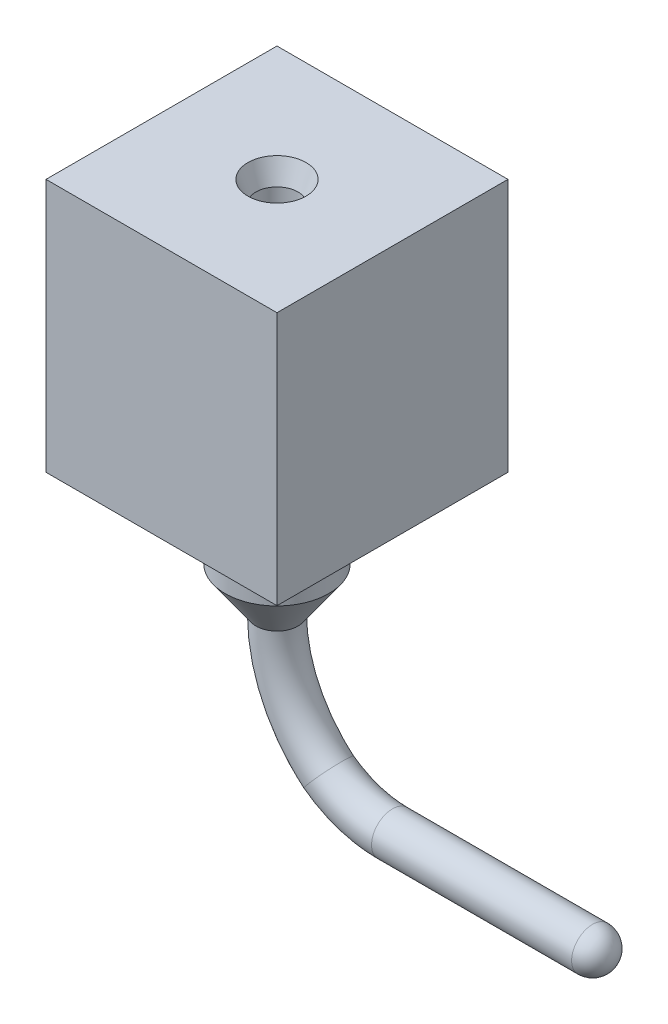
ISO-10303-21;
HEADER;
FILE_DESCRIPTION(('STEP AP214'),'2;1');
FILE_NAME('part.step','',(''),(''),'','','');
FILE_SCHEMA(('AUTOMOTIVE_DESIGN { 1 0 10303 214 1 1 1 1 }'));
ENDSEC;
DATA;
#1=APPLICATION_CONTEXT('core data for automotive mechanical design processes');
#2=APPLICATION_PROTOCOL_DEFINITION('international standard','automotive_design',2000,#1);
#3=PRODUCT_CONTEXT('',#1,'mechanical');
#4=PRODUCT('Part','Part','',(#3));
#5=PRODUCT_RELATED_PRODUCT_CATEGORY('part','',(#4));
#6=PRODUCT_DEFINITION_FORMATION('','',#4);
#7=PRODUCT_DEFINITION_CONTEXT('part definition',#1,'design');
#8=PRODUCT_DEFINITION('design','',#6,#7);
#9=PRODUCT_DEFINITION_SHAPE('','',#8);
#10=(LENGTH_UNIT() NAMED_UNIT(*) SI_UNIT(.MILLI.,.METRE.));
#11=(NAMED_UNIT(*) PLANE_ANGLE_UNIT() SI_UNIT($,.RADIAN.));
#12=(NAMED_UNIT(*) SI_UNIT($,.STERADIAN.) SOLID_ANGLE_UNIT());
#13=UNCERTAINTY_MEASURE_WITH_UNIT(LENGTH_MEASURE(1.E-05),#10,'distance_accuracy_value','');
#14=(GEOMETRIC_REPRESENTATION_CONTEXT(3) GLOBAL_UNCERTAINTY_ASSIGNED_CONTEXT((#13)) GLOBAL_UNIT_ASSIGNED_CONTEXT((#10,
#11,#12)) REPRESENTATION_CONTEXT('',''));
#15=CARTESIAN_POINT('',(0.,0.,0.));
#16=DIRECTION('',(0.,0.,1.));
#17=DIRECTION('',(1.,0.,0.));
#18=AXIS2_PLACEMENT_3D('',#15,#16,#17);
#19=CARTESIAN_POINT('',(-1.27,-0.87,1.27));
#20=DIRECTION('',(0.,1.,0.));
#21=DIRECTION('',(0.,0.,-1.));
#22=AXIS2_PLACEMENT_3D('',#19,#20,#21);
#23=CONICAL_SURFACE('',#22,0.57,0.616275758879199);
#24=CARTESIAN_POINT('',(-1.5,-1.35,1.27));
#25=CARTESIAN_POINT('',(-1.50000007983042,-1.35,1.26623663));
#26=CARTESIAN_POINT('',(-1.49990763593879,-1.35,1.26247326679278));
#27=CARTESIAN_POINT('',(-1.49953827391559,-1.35,1.25495560301661));
#28=CARTESIAN_POINT('',(-1.49926135578404,-1.35,1.25120130244766));
#29=CARTESIAN_POINT('',(-1.49852361848517,-1.35,1.24371081300074));
#30=CARTESIAN_POINT('',(-1.49806279931787,-1.35,1.23997462412276));
#31=CARTESIAN_POINT('',(-1.49695839526593,-1.35,1.23252935762777));
#32=CARTESIAN_POINT('',(-1.49631481038129,-1.35,1.22882028001076));
#33=CARTESIAN_POINT('',(-1.49484641860419,-1.35,1.22143817186182));
#34=CARTESIAN_POINT('',(-1.49402161171173,-1.35,1.21776514132989));
#35=CARTESIAN_POINT('',(-1.49219276475776,-1.35,1.21046397591461));
#36=CARTESIAN_POINT('',(-1.49118872469626,-1.35,1.20683584103127));
#37=CARTESIAN_POINT('',(-1.48900382974056,-1.35,1.19963320743168));
#38=CARTESIAN_POINT('',(-1.48782297484635,-1.35,1.19605870871543));
#39=CARTESIAN_POINT('',(-1.48528729513784,-1.35,1.18897195872415));
#40=CARTESIAN_POINT('',(-1.48393247032352,-1.35,1.18545970744912));
#41=CARTESIAN_POINT('',(-1.48105211463167,-1.35,1.17850591366294));
#42=CARTESIAN_POINT('',(-1.47952658375413,-1.35,1.17506437115179));
#43=CARTESIAN_POINT('',(-1.47630849108265,-1.35,1.16826028587028));
#44=CARTESIAN_POINT('',(-1.47461592928871,-1.35,1.16489774309991));
#45=CARTESIAN_POINT('',(-1.47106785231153,-1.35,1.15825975796013));
#46=CARTESIAN_POINT('',(-1.4692123371283,-1.35,1.15498431559072));
#47=CARTESIAN_POINT('',(-1.46534282347182,-1.35,1.1485284220804));
#48=CARTESIAN_POINT('',(-1.46332882499857,-1.35,1.14534797093948));
#49=CARTESIAN_POINT('',(-1.4591471966606,-1.35,1.13908972187151));
#50=CARTESIAN_POINT('',(-1.45697956679588,-1.35,1.13601192394446));
#51=CARTESIAN_POINT('',(-1.45249589768522,-1.35,1.12996639598902));
#52=CARTESIAN_POINT('',(-1.45017985843928,-1.35,1.12699866596063));
#53=CARTESIAN_POINT('',(-1.44540495010758,-1.35,1.12118042332409));
#54=CARTESIAN_POINT('',(-1.44294608102182,-1.35,1.11832991071594));
#55=CARTESIAN_POINT('',(-1.43789143664147,-1.35,1.11275297005443));
#56=CARTESIAN_POINT('',(-1.43529566134688,-1.35,1.11002654200107));
#57=CARTESIAN_POINT('',(-1.42997345799893,-1.35,1.10470433865312));
#58=CARTESIAN_POINT('',(-1.42724702994557,-1.35,1.10210856335853));
#59=CARTESIAN_POINT('',(-1.42167008928406,-1.35,1.09705391897819));
#60=CARTESIAN_POINT('',(-1.41881957667591,-1.35,1.09459504989242));
#61=CARTESIAN_POINT('',(-1.41300133403937,-1.35,1.08982014156072));
#62=CARTESIAN_POINT('',(-1.41003360401098,-1.35,1.08750410231478));
#63=CARTESIAN_POINT('',(-1.40398807605554,-1.35,1.08302043320413));
#64=CARTESIAN_POINT('',(-1.40091027812849,-1.35,1.08085280333941));
#65=CARTESIAN_POINT('',(-1.39465202906053,-1.35,1.07667117500142));
#66=CARTESIAN_POINT('',(-1.39147157791961,-1.35,1.07465717652814));
#67=CARTESIAN_POINT('',(-1.38501568440927,-1.35,1.07078766287174));
#68=CARTESIAN_POINT('',(-1.38174024203986,-1.35,1.06893214768862));
#69=CARTESIAN_POINT('',(-1.3751022569001,-1.35,1.06538407071114));
#70=CARTESIAN_POINT('',(-1.37173971412975,-1.35,1.06369150891678));
#71=CARTESIAN_POINT('',(-1.36493562884818,-1.35,1.06047341624644));
#72=CARTESIAN_POINT('',(-1.36149408633696,-1.35,1.05894788537045));
#73=CARTESIAN_POINT('',(-1.35454029255099,-1.35,1.05606752967436));
#74=CARTESIAN_POINT('',(-1.35102804127624,-1.35,1.05471270485425));
#75=CARTESIAN_POINT('',(-1.34394129128418,-1.35,1.05217702516156));
#76=CARTESIAN_POINT('',(-1.34036679256687,-1.35,1.05099617028899));
#77=CARTESIAN_POINT('',(-1.33316415897018,-1.35,1.0488112752742));
#78=CARTESIAN_POINT('',(-1.32953602409081,-1.35,1.04780723513198));
#79=CARTESIAN_POINT('',(-1.3222348586647,-1.35,1.04597838839854));
#80=CARTESIAN_POINT('',(-1.31856182811796,-1.35,1.04515358180732));
#81=CARTESIAN_POINT('',(-1.31117972000945,-1.35,1.0436851892072));
#82=CARTESIAN_POINT('',(-1.30747064244768,-1.35,1.0430416031983));
#83=CARTESIAN_POINT('',(-1.30002537580179,-1.35,1.0419372022179));
#84=CARTESIAN_POINT('',(-1.29628918671769,-1.35,1.04147638724639));
#85=CARTESIAN_POINT('',(-1.28879869783391,-1.35,1.0407386384844));
#86=CARTESIAN_POINT('',(-1.28504439803424,-1.35,1.04046170469391));
#87=CARTESIAN_POINT('',(-1.27752673215638,-1.35,1.04009238545171));
#88=CARTESIAN_POINT('',(-1.27376336607819,-1.35,1.04));
#89=CARTESIAN_POINT('',(-1.26623663392181,-1.35,1.04));
#90=CARTESIAN_POINT('',(-1.26247326784362,-1.35,1.04009238545171));
#91=CARTESIAN_POINT('',(-1.25495560196576,-1.35,1.04046170469391));
#92=CARTESIAN_POINT('',(-1.25120130216609,-1.35,1.0407386384844));
#93=CARTESIAN_POINT('',(-1.24371081328231,-1.35,1.04147638724639));
#94=CARTESIAN_POINT('',(-1.23997462419821,-1.35,1.0419372022179));
#95=CARTESIAN_POINT('',(-1.23252935755233,-1.35,1.0430416031983));
#96=CARTESIAN_POINT('',(-1.22882027999055,-1.35,1.0436851892072));
#97=CARTESIAN_POINT('',(-1.22143817188204,-1.35,1.04515358180732));
#98=CARTESIAN_POINT('',(-1.2177651413353,-1.35,1.04597838839854));
#99=CARTESIAN_POINT('',(-1.2104639759092,-1.35,1.04780723513198));
#100=CARTESIAN_POINT('',(-1.20683584102982,-1.35,1.0488112752742));
#101=CARTESIAN_POINT('',(-1.19963320743313,-1.35,1.05099617028899));
#102=CARTESIAN_POINT('',(-1.19605870871582,-1.35,1.05217702516156));
#103=CARTESIAN_POINT('',(-1.18897195872376,-1.35,1.05471270485425));
#104=CARTESIAN_POINT('',(-1.18545970744901,-1.35,1.05606752967436));
#105=CARTESIAN_POINT('',(-1.17850591366304,-1.35,1.05894788537045));
#106=CARTESIAN_POINT('',(-1.17506437115182,-1.35,1.06047341624644));
#107=CARTESIAN_POINT('',(-1.16826028587025,-1.35,1.06369150891678));
#108=CARTESIAN_POINT('',(-1.1648977430999,-1.35,1.06538407071114));
#109=CARTESIAN_POINT('',(-1.15825975796014,-1.35,1.06893214768862));
#110=CARTESIAN_POINT('',(-1.15498431559073,-1.35,1.07078766287174));
#111=CARTESIAN_POINT('',(-1.14852842208039,-1.35,1.07465717652814));
#112=CARTESIAN_POINT('',(-1.14534797093948,-1.35,1.07667117500142));
#113=CARTESIAN_POINT('',(-1.13908972187151,-1.35,1.08085280333941));
#114=CARTESIAN_POINT('',(-1.13601192394446,-1.35,1.08302043320413));
#115=CARTESIAN_POINT('',(-1.12996639598902,-1.35,1.08750410231478));
#116=CARTESIAN_POINT('',(-1.12699866596063,-1.35,1.08982014156072));
#117=CARTESIAN_POINT('',(-1.12118042332409,-1.35,1.09459504989242));
#118=CARTESIAN_POINT('',(-1.11832991071594,-1.35,1.09705391897819));
#119=CARTESIAN_POINT('',(-1.11275297005443,-1.35,1.10210856335853));
#120=CARTESIAN_POINT('',(-1.11002654200107,-1.35,1.10470433865312));
#121=CARTESIAN_POINT('',(-1.10470433865312,-1.35,1.11002654200107));
#122=CARTESIAN_POINT('',(-1.10210856335853,-1.35,1.11275297005443));
#123=CARTESIAN_POINT('',(-1.09705391897819,-1.35,1.11832991071594));
#124=CARTESIAN_POINT('',(-1.09459504989242,-1.35,1.12118042332409));
#125=CARTESIAN_POINT('',(-1.08982014156072,-1.35,1.12699866596063));
#126=CARTESIAN_POINT('',(-1.08750410231478,-1.35,1.12996639598902));
#127=CARTESIAN_POINT('',(-1.08302043320413,-1.35,1.13601192394446));
#128=CARTESIAN_POINT('',(-1.08085280333941,-1.35,1.13908972187151));
#129=CARTESIAN_POINT('',(-1.07667117500142,-1.35,1.14534797093948));
#130=CARTESIAN_POINT('',(-1.07465717652814,-1.35,1.14852842208039));
#131=CARTESIAN_POINT('',(-1.07078766287174,-1.35,1.15498431559073));
#132=CARTESIAN_POINT('',(-1.06893214768862,-1.35,1.15825975796014));
#133=CARTESIAN_POINT('',(-1.06538407071114,-1.35,1.1648977430999));
#134=CARTESIAN_POINT('',(-1.06369150891678,-1.35,1.16826028587025));
#135=CARTESIAN_POINT('',(-1.06047341624644,-1.35,1.17506437115182));
#136=CARTESIAN_POINT('',(-1.05894788537045,-1.35,1.17850591366304));
#137=CARTESIAN_POINT('',(-1.05606752967436,-1.35,1.18545970744901));
#138=CARTESIAN_POINT('',(-1.05471270485425,-1.35,1.18897195872376));
#139=CARTESIAN_POINT('',(-1.05217702516156,-1.35,1.19605870871582));
#140=CARTESIAN_POINT('',(-1.05099617028899,-1.35,1.19963320743313));
#141=CARTESIAN_POINT('',(-1.0488112752742,-1.35,1.20683584102982));
#142=CARTESIAN_POINT('',(-1.04780723513198,-1.35,1.2104639759092));
#143=CARTESIAN_POINT('',(-1.04597838839854,-1.35,1.2177651413353));
#144=CARTESIAN_POINT('',(-1.04515358180732,-1.35,1.22143817188204));
#145=CARTESIAN_POINT('',(-1.0436851892072,-1.35,1.22882027999055));
#146=CARTESIAN_POINT('',(-1.0430416031983,-1.35,1.23252935755233));
#147=CARTESIAN_POINT('',(-1.0419372022179,-1.35,1.23997462419821));
#148=CARTESIAN_POINT('',(-1.04147638724639,-1.35,1.24371081328231));
#149=CARTESIAN_POINT('',(-1.0407386384844,-1.35,1.25120130216609));
#150=CARTESIAN_POINT('',(-1.04046170469391,-1.35,1.25495560196576));
#151=CARTESIAN_POINT('',(-1.04009238545171,-1.35,1.26247326784363));
#152=CARTESIAN_POINT('',(-1.04,-1.35,1.26623663392181));
#153=CARTESIAN_POINT('',(-1.04,-1.35,1.27376336607819));
#154=CARTESIAN_POINT('',(-1.04009238545171,-1.35,1.27752673215638));
#155=CARTESIAN_POINT('',(-1.04046170469391,-1.35,1.28504439803424));
#156=CARTESIAN_POINT('',(-1.0407386384844,-1.35,1.28879869783391));
#157=CARTESIAN_POINT('',(-1.04147638724639,-1.35,1.29628918671769));
#158=CARTESIAN_POINT('',(-1.0419372022179,-1.35,1.30002537580179));
#159=CARTESIAN_POINT('',(-1.0430416031983,-1.35,1.30747064244768));
#160=CARTESIAN_POINT('',(-1.0436851892072,-1.35,1.31117972000945));
#161=CARTESIAN_POINT('',(-1.04515358180732,-1.35,1.31856182811797));
#162=CARTESIAN_POINT('',(-1.04597838839854,-1.35,1.3222348586647));
#163=CARTESIAN_POINT('',(-1.04780723513198,-1.35,1.32953602409081));
#164=CARTESIAN_POINT('',(-1.0488112752742,-1.35,1.33316415897018));
#165=CARTESIAN_POINT('',(-1.05099617028899,-1.35,1.34036679256687));
#166=CARTESIAN_POINT('',(-1.05217702516156,-1.35,1.34394129128418));
#167=CARTESIAN_POINT('',(-1.05471270485425,-1.35,1.35102804127624));
#168=CARTESIAN_POINT('',(-1.05606752967436,-1.35,1.35454029255099));
#169=CARTESIAN_POINT('',(-1.05894788537045,-1.35,1.36149408633696));
#170=CARTESIAN_POINT('',(-1.06047341624644,-1.35,1.36493562884818));
#171=CARTESIAN_POINT('',(-1.06369150891678,-1.35,1.37173971412975));
#172=CARTESIAN_POINT('',(-1.06538407071114,-1.35,1.3751022569001));
#173=CARTESIAN_POINT('',(-1.06893214768862,-1.35,1.38174024203986));
#174=CARTESIAN_POINT('',(-1.07078766287174,-1.35,1.38501568440927));
#175=CARTESIAN_POINT('',(-1.07465717652814,-1.35,1.39147157791961));
#176=CARTESIAN_POINT('',(-1.07667117500142,-1.35,1.39465202906053));
#177=CARTESIAN_POINT('',(-1.08085280333941,-1.35,1.40091027812849));
#178=CARTESIAN_POINT('',(-1.08302043320413,-1.35,1.40398807605554));
#179=CARTESIAN_POINT('',(-1.08750410231478,-1.35,1.41003360401098));
#180=CARTESIAN_POINT('',(-1.08982014156072,-1.35,1.41300133403937));
#181=CARTESIAN_POINT('',(-1.09459504989242,-1.35,1.41881957667591));
#182=CARTESIAN_POINT('',(-1.09705391897819,-1.35,1.42167008928406));
#183=CARTESIAN_POINT('',(-1.10210856335853,-1.35,1.42724702994557));
#184=CARTESIAN_POINT('',(-1.10470433865312,-1.35,1.42997345799893));
#185=CARTESIAN_POINT('',(-1.11002654200107,-1.35,1.43529566134688));
#186=CARTESIAN_POINT('',(-1.11275297005443,-1.35,1.43789143664147));
#187=CARTESIAN_POINT('',(-1.11832991071594,-1.35,1.44294608102182));
#188=CARTESIAN_POINT('',(-1.12118042332409,-1.35,1.44540495010758));
#189=CARTESIAN_POINT('',(-1.12699866596063,-1.35,1.45017985843928));
#190=CARTESIAN_POINT('',(-1.12996639598902,-1.35,1.45249589768522));
#191=CARTESIAN_POINT('',(-1.13601192394446,-1.35,1.45697956679588));
#192=CARTESIAN_POINT('',(-1.13908972187151,-1.35,1.45914719666059));
#193=CARTESIAN_POINT('',(-1.14534797093948,-1.35,1.46332882499858));
#194=CARTESIAN_POINT('',(-1.14852842208039,-1.35,1.46534282347186));
#195=CARTESIAN_POINT('',(-1.15498431559073,-1.35,1.46921233712826));
#196=CARTESIAN_POINT('',(-1.15825975796014,-1.35,1.47106785231138));
#197=CARTESIAN_POINT('',(-1.1648977430999,-1.35,1.47461592928886));
#198=CARTESIAN_POINT('',(-1.16826028587025,-1.35,1.47630849108322));
#199=CARTESIAN_POINT('',(-1.17506437115182,-1.35,1.47952658375356));
#200=CARTESIAN_POINT('',(-1.17850591366304,-1.35,1.48105211462955));
#201=CARTESIAN_POINT('',(-1.18545970744901,-1.35,1.48393247032564));
#202=CARTESIAN_POINT('',(-1.18897195872376,-1.35,1.48528729514575));
#203=CARTESIAN_POINT('',(-1.19605870871582,-1.35,1.48782297483844));
#204=CARTESIAN_POINT('',(-1.19963320743313,-1.35,1.48900382971101));
#205=CARTESIAN_POINT('',(-1.20683584102982,-1.35,1.49118872472581));
#206=CARTESIAN_POINT('',(-1.2104639759092,-1.35,1.49219276486803));
#207=CARTESIAN_POINT('',(-1.2177651413353,-1.35,1.49402161160147));
#208=CARTESIAN_POINT('',(-1.22143817188204,-1.35,1.49484641819268));
#209=CARTESIAN_POINT('',(-1.22882027999055,-1.35,1.4963148107928));
#210=CARTESIAN_POINT('',(-1.23252935755233,-1.35,1.4969583968017));
#211=CARTESIAN_POINT('',(-1.23997462419821,-1.35,1.4980627977821));
#212=CARTESIAN_POINT('',(-1.24371081328231,-1.35,1.49852361275361));
#213=CARTESIAN_POINT('',(-1.25120130216609,-1.35,1.4992613615156));
#214=CARTESIAN_POINT('',(-1.25495560196576,-1.35,1.49953829530609));
#215=CARTESIAN_POINT('',(-1.26247326784363,-1.35,1.49990761454829));
#216=CARTESIAN_POINT('',(-1.26623663392181,-1.35,1.5));
#217=CARTESIAN_POINT('',(-1.27376336607819,-1.35,1.5));
#218=CARTESIAN_POINT('',(-1.27752673215638,-1.35,1.49990761454829));
#219=CARTESIAN_POINT('',(-1.28504439803424,-1.35,1.49953829530609));
#220=CARTESIAN_POINT('',(-1.28879869783391,-1.35,1.4992613615156));
#221=CARTESIAN_POINT('',(-1.29628918671769,-1.35,1.49852361275361));
#222=CARTESIAN_POINT('',(-1.30002537580179,-1.35,1.4980627977821));
#223=CARTESIAN_POINT('',(-1.30747064244768,-1.35,1.4969583968017));
#224=CARTESIAN_POINT('',(-1.31117972000945,-1.35,1.4963148107928));
#225=CARTESIAN_POINT('',(-1.31856182811796,-1.35,1.49484641819268));
#226=CARTESIAN_POINT('',(-1.3222348586647,-1.35,1.49402161160147));
#227=CARTESIAN_POINT('',(-1.32953602409081,-1.35,1.49219276486803));
#228=CARTESIAN_POINT('',(-1.33316415897018,-1.35,1.49118872472581));
#229=CARTESIAN_POINT('',(-1.34036679256687,-1.35,1.48900382971101));
#230=CARTESIAN_POINT('',(-1.34394129128418,-1.35,1.48782297483844));
#231=CARTESIAN_POINT('',(-1.35102804127624,-1.35,1.48528729514575));
#232=CARTESIAN_POINT('',(-1.35454029255099,-1.35,1.48393247032564));
#233=CARTESIAN_POINT('',(-1.36149408633696,-1.35,1.48105211462955));
#234=CARTESIAN_POINT('',(-1.36493562884818,-1.35,1.47952658375356));
#235=CARTESIAN_POINT('',(-1.37173971412975,-1.35,1.47630849108322));
#236=CARTESIAN_POINT('',(-1.3751022569001,-1.35,1.47461592928886));
#237=CARTESIAN_POINT('',(-1.38174024203986,-1.35,1.47106785231138));
#238=CARTESIAN_POINT('',(-1.38501568440927,-1.35,1.46921233712826));
#239=CARTESIAN_POINT('',(-1.39147157791961,-1.35,1.46534282347186));
#240=CARTESIAN_POINT('',(-1.39465202906053,-1.35,1.46332882499858));
#241=CARTESIAN_POINT('',(-1.40091027812849,-1.35,1.45914719666059));
#242=CARTESIAN_POINT('',(-1.40398807605554,-1.35,1.45697956679588));
#243=CARTESIAN_POINT('',(-1.41003360401098,-1.35,1.45249589768522));
#244=CARTESIAN_POINT('',(-1.41300133403937,-1.35,1.45017985843928));
#245=CARTESIAN_POINT('',(-1.41881957667591,-1.35,1.44540495010758));
#246=CARTESIAN_POINT('',(-1.42167008928406,-1.35,1.44294608102182));
#247=CARTESIAN_POINT('',(-1.42724702994557,-1.35,1.43789143664147));
#248=CARTESIAN_POINT('',(-1.42997345799893,-1.35,1.43529566134688));
#249=CARTESIAN_POINT('',(-1.43529566134688,-1.35,1.42997345799893));
#250=CARTESIAN_POINT('',(-1.43789143664147,-1.35,1.42724702994557));
#251=CARTESIAN_POINT('',(-1.44294608102182,-1.35,1.42167008928406));
#252=CARTESIAN_POINT('',(-1.44540495010758,-1.35,1.41881957667591));
#253=CARTESIAN_POINT('',(-1.45017985843928,-1.35,1.41300133403937));
#254=CARTESIAN_POINT('',(-1.45249589768522,-1.35,1.41003360401098));
#255=CARTESIAN_POINT('',(-1.45697956679588,-1.35,1.40398807605554));
#256=CARTESIAN_POINT('',(-1.4591471966606,-1.35,1.40091027812849));
#257=CARTESIAN_POINT('',(-1.46332882499857,-1.35,1.39465202906052));
#258=CARTESIAN_POINT('',(-1.46534282347182,-1.35,1.39147157791961));
#259=CARTESIAN_POINT('',(-1.4692123371283,-1.35,1.38501568440928));
#260=CARTESIAN_POINT('',(-1.47106785231153,-1.35,1.38174024203987));
#261=CARTESIAN_POINT('',(-1.47461592928871,-1.35,1.37510225690009));
#262=CARTESIAN_POINT('',(-1.47630849108265,-1.35,1.37173971412972));
#263=CARTESIAN_POINT('',(-1.47952658375413,-1.35,1.36493562884821));
#264=CARTESIAN_POINT('',(-1.48105211463167,-1.35,1.36149408633706));
#265=CARTESIAN_POINT('',(-1.48393247032352,-1.35,1.35454029255088));
#266=CARTESIAN_POINT('',(-1.48528729513784,-1.35,1.35102804127585));
#267=CARTESIAN_POINT('',(-1.48782297484635,-1.35,1.34394129128457));
#268=CARTESIAN_POINT('',(-1.48900382974056,-1.35,1.34036679256832));
#269=CARTESIAN_POINT('',(-1.49118872469626,-1.35,1.33316415896873));
#270=CARTESIAN_POINT('',(-1.49219276475776,-1.35,1.32953602408539));
#271=CARTESIAN_POINT('',(-1.49402161171173,-1.35,1.32223485867011));
#272=CARTESIAN_POINT('',(-1.49484641860419,-1.35,1.31856182813818));
#273=CARTESIAN_POINT('',(-1.49631481038129,-1.35,1.31117971998924));
#274=CARTESIAN_POINT('',(-1.49695839526593,-1.35,1.30747064237223));
#275=CARTESIAN_POINT('',(-1.49806279931787,-1.35,1.30002537587724));
#276=CARTESIAN_POINT('',(-1.49852361848517,-1.35,1.29628918699926));
#277=CARTESIAN_POINT('',(-1.49926135578404,-1.35,1.28879869755234));
#278=CARTESIAN_POINT('',(-1.49953827391559,-1.35,1.28504439698339));
#279=CARTESIAN_POINT('',(-1.49990763593879,-1.35,1.27752673320722));
#280=CARTESIAN_POINT('',(-1.50000007983042,-1.35,1.27376337000001));
#281=CARTESIAN_POINT('',(-1.5,-1.35,1.27));
#282=B_SPLINE_CURVE_WITH_KNOTS('',3,(#24,#25,#26,#27,#28,#29,#30,#31,#32,#33,#34,#35,#36,#37,
#38,#39,#40,#41,#42,#43,#44,#45,#46,#47,#48,#49,#50,#51,#52,#53,#54,#55,#56,#57,#58,#59,#60,#61,
#62,#63,#64,#65,#66,#67,#68,#69,#70,#71,#72,#73,#74,#75,#76,#77,#78,#79,#80,#81,#82,#83,#84,#85,
#86,#87,#88,#89,#90,#91,#92,#93,#94,#95,#96,#97,#98,#99,#100,#101,#102,#103,#104,#105,#106,#107,
#108,#109,#110,#111,#112,#113,#114,#115,#116,#117,#118,#119,#120,#121,#122,#123,#124,#125,#126,
#127,#128,#129,#130,#131,#132,#133,#134,#135,#136,#137,#138,#139,#140,#141,#142,#143,#144,#145,
#146,#147,#148,#149,#150,#151,#152,#153,#154,#155,#156,#157,#158,#159,#160,#161,#162,#163,#164,
#165,#166,#167,#168,#169,#170,#171,#172,#173,#174,#175,#176,#177,#178,#179,#180,#181,#182,#183,
#184,#185,#186,#187,#188,#189,#190,#191,#192,#193,#194,#195,#196,#197,#198,#199,#200,#201,#202,
#203,#204,#205,#206,#207,#208,#209,#210,#211,#212,#213,#214,#215,#216,#217,#218,#219,#220,#221,
#222,#223,#224,#225,#226,#227,#228,#229,#230,#231,#232,#233,#234,#235,#236,#237,#238,#239,#240,
#241,#242,#243,#244,#245,#246,#247,#248,#249,#250,#251,#252,#253,#254,#255,#256,#257,#258,#259,
#260,#261,#262,#263,#264,#265,#266,#267,#268,#269,#270,#271,#272,#273,#274,#275,#276,#277,#278,
#279,#280,#281),.UNSPECIFIED.,.F.,.F.,(4,2,2,2,2,2,2,2,2,2,2,2,2,2,2,2,2,2,2,2,2,2,2,2,2,2,2,2,
2,2,2,2,2,2,2,2,2,2,2,2,2,2,2,2,2,2,2,2,2,2,2,2,2,2,2,2,2,2,2,2,2,2,2,2,2,2,2,2,2,2,2,2,2,2,2,2,
2,2,2,2,2,2,2,2,2,2,2,2,2,2,2,2,2,2,2,2,2,2,2,2,2,2,2,2,2,2,2,2,2,2,2,2,2,2,2,2,2,2,2,2,2,2,2,2,
2,2,2,2,4),(0.,0.0112889651205398,0.0225779302410793,0.0338668953616192,0.0451558604821587,
0.0564448256026984,0.0677337907232381,0.0790227558437775,0.0903117209643174,0.101600686084857,
0.112889651205396,0.124178616325936,0.135467581446476,0.146756546567015,0.158045511687555,
0.169334476808095,0.180623441928634,0.191912407049174,0.203201372169714,0.214490337290254,
0.225779302410793,0.237068267531333,0.248357232651872,0.259646197772412,0.270935162892952,
0.282224128013491,0.293513093134031,0.304802058254571,0.31609102337511,0.32737998849565,
0.338668953616189,0.349957918736729,0.361246883857269,0.372535848977809,0.383824814098348,
0.395113779218888,0.406402744339427,0.417691709459967,0.428980674580507,0.440269639701046,
0.451558604821586,0.462847569942126,0.474136535062665,0.485425500183205,0.496714465303745,
0.508003430424284,0.519292395544824,0.530581360665363,0.541870325785903,0.553159290906443,
0.564448256026983,0.575737221147522,0.587026186268062,0.598315151388602,0.609604116509141,
0.620893081629681,0.63218204675022,0.64347101187076,0.6547599769913,0.666048942111839,
0.677337907232379,0.688626872352919,0.699915837473458,0.711204802593998,0.722493767714538,
0.733782732835077,0.745071697955617,0.756360663076157,0.767649628196696,0.778938593317236,
0.790227558437775,0.801516523558315,0.812805488678855,0.824094453799395,0.835383418919934,
0.846672384040474,0.857961349161013,0.869250314281553,0.880539279402093,0.891828244522632,
0.903117209643172,0.914406174763712,0.925695139884251,0.936984105004791,0.948273070125331,
0.95956203524587,0.97085100036641,0.98213996548695,0.993428930607489,1.00471789572803,
1.01600686084857,1.02729582596911,1.03858479108965,1.04987375621019,1.06116272133073,
1.07245168645127,1.08374065157181,1.09502961669235,1.10631858181289,1.11760754693343,
1.12889651205397,1.14018547717451,1.15147444229504,1.16276340741558,1.17405237253612,
1.18534133765666,1.1966303027772,1.20791926789774,1.21920823301828,1.23049719813882,
1.24178616325936,1.2530751283799,1.26436409350044,1.27565305862098,1.28694202374152,
1.29823098886206,1.3095199539826,1.32080891910314,1.33209788422368,1.34338684934422,
1.35467581446476,1.3659647795853,1.37725374470584,1.38854270982638,1.39983167494692,
1.41112064006746,1.422409605188,1.43369857030854,1.44498753542908),.UNSPECIFIED.);
#283=CARTESIAN_POINT('',(-1.5,-1.35,1.27));
#284=VERTEX_POINT('',#283);
#285=EDGE_CURVE('E13',#284,#284,#282,.T.);
#286=ORIENTED_EDGE('',*,*,#285,.F.);
#287=EDGE_LOOP('',(#286));
#288=FACE_BOUND('',#287,.T.);
#289=CARTESIAN_POINT('',(-1.27,-0.87,1.27));
#290=DIRECTION('',(0.,-1.,0.));
#291=DIRECTION('',(0.,0.,-1.));
#292=AXIS2_PLACEMENT_3D('',#289,#290,#291);
#293=CIRCLE('',#292,0.57);
#294=CARTESIAN_POINT('',(-1.27,-0.87,0.7));
#295=VERTEX_POINT('',#294);
#296=EDGE_CURVE('E67',#295,#295,#293,.T.);
#297=ORIENTED_EDGE('',*,*,#296,.T.);
#298=EDGE_LOOP('',(#297));
#299=FACE_BOUND('',#298,.T.);
#300=ADVANCED_FACE('F58',(#288,#299),#23,.T.);
#301=CARTESIAN_POINT('',(-1.27,-0.87,1.27));
#302=DIRECTION('',(0.,-1.,0.));
#303=DIRECTION('',(0.,0.,-1.));
#304=AXIS2_PLACEMENT_3D('',#301,#302,#303);
#305=PLANE('',#304);
#306=ORIENTED_EDGE('',*,*,#296,.F.);
#307=EDGE_LOOP('',(#306));
#308=FACE_BOUND('',#307,.T.);
#309=ADVANCED_FACE('F98',(#308),#305,.F.);
#310=CARTESIAN_POINT('',(0.,-1.61978260869565,1.27));
#311=DIRECTION('',(0.,0.,1.));
#312=DIRECTION('',(1.,0.,0.));
#313=AXIS2_PLACEMENT_3D('',#310,#311,#312);
#314=TOROIDAL_SURFACE('',#313,1.18021739130434,0.23);
#315=CARTESIAN_POINT('',(0.,-2.8,1.27));
#316=DIRECTION('',(1.,0.,0.));
#317=DIRECTION('',(0.,1.,0.));
#318=AXIS2_PLACEMENT_3D('',#315,#316,#317);
#319=CIRCLE('',#318,0.23);
#320=CARTESIAN_POINT('',(0.,-2.57,1.27));
#321=VERTEX_POINT('',#320);
#322=EDGE_CURVE('E138',#321,#321,#319,.T.);
#323=ORIENTED_EDGE('',*,*,#322,.F.);
#324=EDGE_LOOP('',(#323));
#325=FACE_BOUND('',#324,.T.);
#326=CARTESIAN_POINT('',(-0.700000000000001,-2.57,1.27));
#327=DIRECTION('',(-0.766999393371202,0.641647824408537,0.));
#328=DIRECTION('',(-0.641647824408537,-0.766999393371201,0.));
#329=AXIS2_PLACEMENT_3D('',#326,#327,#328);
#330=CIRCLE('',#329,0.23);
#331=CARTESIAN_POINT('',(-0.84199727287753,-2.75079380480022,1.27));
#332=VERTEX_POINT('',#331);
#333=EDGE_CURVE('E71',#332,#332,#330,.T.);
#334=ORIENTED_EDGE('',*,*,#333,.F.);
#335=EDGE_LOOP('',(#334));
#336=FACE_BOUND('',#335,.T.);
#337=ADVANCED_FACE('F97',(#325,#336),#314,.T.);
#338=CARTESIAN_POINT('',(0.320614035087717,-1.35,1.27));
#339=DIRECTION('',(0.,0.,1.));
#340=DIRECTION('',(1.,0.,0.));
#341=AXIS2_PLACEMENT_3D('',#338,#339,#340);
#342=TOROIDAL_SURFACE('',#341,1.59061403508772,0.23);
#343=ORIENTED_EDGE('',*,*,#333,.T.);
#344=EDGE_LOOP('',(#343));
#345=FACE_BOUND('',#344,.T.);
#346=ORIENTED_EDGE('',*,*,#285,.T.);
#347=EDGE_LOOP('',(#346));
#348=FACE_BOUND('',#347,.T.);
#349=ADVANCED_FACE('F73',(#345,#348),#342,.T.);
#350=CARTESIAN_POINT('',(2.2,-2.8,1.27));
#351=DIRECTION('',(-1.,0.,0.));
#352=DIRECTION('',(0.,-1.,0.));
#353=AXIS2_PLACEMENT_3D('',#350,#351,#352);
#354=CYLINDRICAL_SURFACE('',#353,0.23);
#355=CARTESIAN_POINT('',(2.2,-2.8,1.27));
#356=DIRECTION('',(1.,0.,0.));
#357=DIRECTION('',(0.,1.,0.));
#358=AXIS2_PLACEMENT_3D('',#355,#356,#357);
#359=CIRCLE('',#358,0.23);
#360=CARTESIAN_POINT('',(2.2,-2.57,1.27));
#361=VERTEX_POINT('',#360);
#362=EDGE_CURVE('E77',#361,#361,#359,.T.);
#363=ORIENTED_EDGE('',*,*,#362,.F.);
#364=EDGE_LOOP('',(#363));
#365=FACE_BOUND('',#364,.T.);
#366=ORIENTED_EDGE('',*,*,#322,.T.);
#367=EDGE_LOOP('',(#366));
#368=FACE_BOUND('',#367,.T.);
#369=ADVANCED_FACE('F96',(#365,#368),#354,.T.);
#370=CARTESIAN_POINT('',(2.2,-2.8,1.27));
#371=DIRECTION('',(-1.,0.,0.));
#372=DIRECTION('',(0.,-1.,0.));
#373=AXIS2_PLACEMENT_3D('',#370,#371,#372);
#374=SPHERICAL_SURFACE('',#373,0.23);
#375=ORIENTED_EDGE('',*,*,#362,.T.);
#376=EDGE_LOOP('',(#375));
#377=FACE_BOUND('',#376,.T.);
#378=ADVANCED_FACE('F128',(#377),#374,.T.);
#379=CLOSED_SHELL('',(#300,#309,#337,#349,#369,#378));
#380=MANIFOLD_SOLID_BREP('B2',#379);
#381=CARTESIAN_POINT('',(0.,2.79,0.));
#382=DIRECTION('',(-1.,0.,0.));
#383=DIRECTION('',(0.,0.,1.));
#384=AXIS2_PLACEMENT_3D('',#381,#382,#383);
#385=PLANE('',#384);
#386=DIRECTION('',(0.,0.,-1.));
#387=VECTOR('',#386,1.);
#388=CARTESIAN_POINT('',(0.,0.,0.));
#389=LINE('',#388,#387);
#390=CARTESIAN_POINT('',(0.,0.,2.54));
#391=VERTEX_POINT('',#390);
#392=CARTESIAN_POINT('',(0.,0.,0.));
#393=VERTEX_POINT('',#392);
#394=EDGE_CURVE('E251',#391,#393,#389,.T.);
#395=ORIENTED_EDGE('',*,*,#394,.T.);
#396=DIRECTION('',(0.,-1.,0.));
#397=VECTOR('',#396,1.);
#398=CARTESIAN_POINT('',(0.,2.79,0.));
#399=LINE('',#398,#397);
#400=CARTESIAN_POINT('',(0.,2.79,0.));
#401=VERTEX_POINT('',#400);
#402=EDGE_CURVE('E56',#401,#393,#399,.T.);
#403=ORIENTED_EDGE('',*,*,#402,.F.);
#404=DIRECTION('',(0.,0.,-1.));
#405=VECTOR('',#404,1.);
#406=CARTESIAN_POINT('',(0.,2.79,0.));
#407=LINE('',#406,#405);
#408=CARTESIAN_POINT('',(0.,2.79,2.54));
#409=VERTEX_POINT('',#408);
#410=EDGE_CURVE('E238',#409,#401,#407,.T.);
#411=ORIENTED_EDGE('',*,*,#410,.F.);
#412=DIRECTION('',(0.,-1.,0.));
#413=VECTOR('',#412,1.);
#414=CARTESIAN_POINT('',(0.,2.79,2.54));
#415=LINE('',#414,#413);
#416=EDGE_CURVE('E247',#409,#391,#415,.T.);
#417=ORIENTED_EDGE('',*,*,#416,.T.);
#418=EDGE_LOOP('',(#395,#403,#411,#417));
#419=FACE_BOUND('',#418,.T.);
#420=ADVANCED_FACE('F186',(#419),#385,.F.);
#421=CARTESIAN_POINT('',(0.,2.79,0.));
#422=DIRECTION('',(0.,0.,1.));
#423=DIRECTION('',(1.,0.,0.));
#424=AXIS2_PLACEMENT_3D('',#421,#422,#423);
#425=PLANE('',#424);
#426=DIRECTION('',(-1.,0.,0.));
#427=VECTOR('',#426,1.);
#428=CARTESIAN_POINT('',(0.,0.,0.));
#429=LINE('',#428,#427);
#430=CARTESIAN_POINT('',(-2.54,0.,0.));
#431=VERTEX_POINT('',#430);
#432=EDGE_CURVE('E242',#393,#431,#429,.T.);
#433=ORIENTED_EDGE('',*,*,#432,.T.);
#434=DIRECTION('',(0.,-1.,0.));
#435=VECTOR('',#434,1.);
#436=CARTESIAN_POINT('',(-2.54,2.79,0.));
#437=LINE('',#436,#435);
#438=CARTESIAN_POINT('',(-2.54,2.79,0.));
#439=VERTEX_POINT('',#438);
#440=EDGE_CURVE('E195',#439,#431,#437,.T.);
#441=ORIENTED_EDGE('',*,*,#440,.F.);
#442=DIRECTION('',(-1.,0.,0.));
#443=VECTOR('',#442,1.);
#444=CARTESIAN_POINT('',(0.,2.79,0.));
#445=LINE('',#444,#443);
#446=EDGE_CURVE('E233',#401,#439,#445,.T.);
#447=ORIENTED_EDGE('',*,*,#446,.F.);
#448=ORIENTED_EDGE('',*,*,#402,.T.);
#449=EDGE_LOOP('',(#433,#441,#447,#448));
#450=FACE_BOUND('',#449,.T.);
#451=ADVANCED_FACE('F241',(#450),#425,.F.);
#452=CARTESIAN_POINT('',(-2.54,2.79,0.));
#453=DIRECTION('',(1.,0.,0.));
#454=DIRECTION('',(0.,0.,-1.));
#455=AXIS2_PLACEMENT_3D('',#452,#453,#454);
#456=PLANE('',#455);
#457=DIRECTION('',(0.,0.,1.));
#458=VECTOR('',#457,1.);
#459=CARTESIAN_POINT('',(-2.54,0.,0.));
#460=LINE('',#459,#458);
#461=CARTESIAN_POINT('',(-2.54,0.,2.54));
#462=VERTEX_POINT('',#461);
#463=EDGE_CURVE('E220',#431,#462,#460,.T.);
#464=ORIENTED_EDGE('',*,*,#463,.T.);
#465=DIRECTION('',(0.,-1.,0.));
#466=VECTOR('',#465,1.);
#467=CARTESIAN_POINT('',(-2.54,2.79,2.54));
#468=LINE('',#467,#466);
#469=CARTESIAN_POINT('',(-2.54,2.79,2.54));
#470=VERTEX_POINT('',#469);
#471=EDGE_CURVE('E243',#470,#462,#468,.T.);
#472=ORIENTED_EDGE('',*,*,#471,.F.);
#473=DIRECTION('',(0.,0.,1.));
#474=VECTOR('',#473,1.);
#475=CARTESIAN_POINT('',(-2.54,2.79,0.));
#476=LINE('',#475,#474);
#477=EDGE_CURVE('E236',#439,#470,#476,.T.);
#478=ORIENTED_EDGE('',*,*,#477,.F.);
#479=ORIENTED_EDGE('',*,*,#440,.T.);
#480=EDGE_LOOP('',(#464,#472,#478,#479));
#481=FACE_BOUND('',#480,.T.);
#482=ADVANCED_FACE('F245',(#481),#456,.F.);
#483=CARTESIAN_POINT('',(0.,2.79,2.54));
#484=DIRECTION('',(0.,0.,-1.));
#485=DIRECTION('',(-1.,0.,0.));
#486=AXIS2_PLACEMENT_3D('',#483,#484,#485);
#487=PLANE('',#486);
#488=DIRECTION('',(1.,0.,0.));
#489=VECTOR('',#488,1.);
#490=CARTESIAN_POINT('',(0.,0.,2.54));
#491=LINE('',#490,#489);
#492=EDGE_CURVE('E226',#462,#391,#491,.T.);
#493=ORIENTED_EDGE('',*,*,#492,.T.);
#494=ORIENTED_EDGE('',*,*,#416,.F.);
#495=DIRECTION('',(1.,0.,0.));
#496=VECTOR('',#495,1.);
#497=CARTESIAN_POINT('',(0.,2.79,2.54));
#498=LINE('',#497,#496);
#499=EDGE_CURVE('E203',#470,#409,#498,.T.);
#500=ORIENTED_EDGE('',*,*,#499,.F.);
#501=ORIENTED_EDGE('',*,*,#471,.T.);
#502=EDGE_LOOP('',(#493,#494,#500,#501));
#503=FACE_BOUND('',#502,.T.);
#504=ADVANCED_FACE('F259',(#503),#487,.F.);
#505=CARTESIAN_POINT('',(0.,2.79,0.));
#506=DIRECTION('',(0.,-1.,0.));
#507=DIRECTION('',(0.,0.,-1.));
#508=AXIS2_PLACEMENT_3D('',#505,#506,#507);
#509=PLANE('',#508);
#510=CARTESIAN_POINT('',(-1.27,2.79,1.27));
#511=DIRECTION('',(0.,1.,0.));
#512=DIRECTION('',(0.,0.,1.));
#513=AXIS2_PLACEMENT_3D('',#510,#511,#512);
#514=CIRCLE('',#513,0.32);
#515=CARTESIAN_POINT('',(-1.27,2.79,1.59));
#516=VERTEX_POINT('',#515);
#517=EDGE_CURVE('E273',#516,#516,#514,.T.);
#518=ORIENTED_EDGE('',*,*,#517,.F.);
#519=EDGE_LOOP('',(#518));
#520=FACE_BOUND('',#519,.T.);
#521=ORIENTED_EDGE('',*,*,#410,.T.);
#522=ORIENTED_EDGE('',*,*,#446,.T.);
#523=ORIENTED_EDGE('',*,*,#477,.T.);
#524=ORIENTED_EDGE('',*,*,#499,.T.);
#525=EDGE_LOOP('',(#521,#522,#523,#524));
#526=FACE_BOUND('',#525,.T.);
#527=ADVANCED_FACE('F234',(#520,#526),#509,.F.);
#528=CARTESIAN_POINT('',(0.,0.,0.));
#529=DIRECTION('',(0.,-1.,0.));
#530=DIRECTION('',(0.,0.,-1.));
#531=AXIS2_PLACEMENT_3D('',#528,#529,#530);
#532=PLANE('',#531);
#533=CARTESIAN_POINT('',(-1.27,0.,1.27));
#534=DIRECTION('',(0.,-1.,0.));
#535=DIRECTION('',(0.,0.,-1.));
#536=AXIS2_PLACEMENT_3D('',#533,#534,#535);
#537=CIRCLE('',#536,0.57);
#538=CARTESIAN_POINT('',(-1.27,0.,0.7));
#539=VERTEX_POINT('',#538);
#540=EDGE_CURVE('E265',#539,#539,#537,.T.);
#541=ORIENTED_EDGE('',*,*,#540,.F.);
#542=EDGE_LOOP('',(#541));
#543=FACE_BOUND('',#542,.T.);
#544=ORIENTED_EDGE('',*,*,#394,.F.);
#545=ORIENTED_EDGE('',*,*,#492,.F.);
#546=ORIENTED_EDGE('',*,*,#463,.F.);
#547=ORIENTED_EDGE('',*,*,#432,.F.);
#548=EDGE_LOOP('',(#544,#545,#546,#547));
#549=FACE_BOUND('',#548,.T.);
#550=ADVANCED_FACE('F262',(#543,#549),#532,.T.);
#551=CARTESIAN_POINT('',(-1.27,-0.87,1.27));
#552=DIRECTION('',(0.,1.,0.));
#553=DIRECTION('',(0.,0.,1.));
#554=AXIS2_PLACEMENT_3D('',#551,#552,#553);
#555=CYLINDRICAL_SURFACE('',#554,0.57);
#556=CARTESIAN_POINT('',(-1.27,-0.87,1.27));
#557=DIRECTION('',(0.,-1.,0.));
#558=DIRECTION('',(0.,0.,-1.));
#559=AXIS2_PLACEMENT_3D('',#556,#557,#558);
#560=CIRCLE('',#559,0.57);
#561=CARTESIAN_POINT('',(-1.27,-0.87,0.7));
#562=VERTEX_POINT('',#561);
#563=EDGE_CURVE('E254',#562,#562,#560,.T.);
#564=ORIENTED_EDGE('',*,*,#563,.F.);
#565=EDGE_LOOP('',(#564));
#566=FACE_BOUND('',#565,.T.);
#567=ORIENTED_EDGE('',*,*,#540,.T.);
#568=EDGE_LOOP('',(#567));
#569=FACE_BOUND('',#568,.T.);
#570=ADVANCED_FACE('F294',(#566,#569),#555,.T.);
#571=CARTESIAN_POINT('',(-1.27,-0.87,1.27));
#572=DIRECTION('',(0.,-1.,0.));
#573=DIRECTION('',(0.,0.,-1.));
#574=AXIS2_PLACEMENT_3D('',#571,#572,#573);
#575=PLANE('',#574);
#576=ORIENTED_EDGE('',*,*,#563,.T.);
#577=EDGE_LOOP('',(#576));
#578=FACE_BOUND('',#577,.T.);
#579=ADVANCED_FACE('F286',(#578),#575,.T.);
#580=CARTESIAN_POINT('',(-1.27,2.79,1.27));
#581=DIRECTION('',(0.,1.,0.));
#582=DIRECTION('',(0.,0.,1.));
#583=AXIS2_PLACEMENT_3D('',#580,#581,#582);
#584=CONICAL_SURFACE('',#583,0.32,0.366519142918809);
#585=ORIENTED_EDGE('',*,*,#517,.T.);
#586=EDGE_LOOP('',(#585));
#587=FACE_BOUND('',#586,.T.);
#588=CARTESIAN_POINT('',(-1.27,2.55554198417756,1.27));
#589=DIRECTION('',(0.,1.,0.));
#590=DIRECTION('',(0.,0.,1.));
#591=AXIS2_PLACEMENT_3D('',#588,#589,#590);
#592=CIRCLE('',#591,0.23);
#593=CARTESIAN_POINT('',(-1.27,2.55554198417756,1.5));
#594=VERTEX_POINT('',#593);
#595=EDGE_CURVE('E189',#594,#594,#592,.T.);
#596=ORIENTED_EDGE('',*,*,#595,.F.);
#597=EDGE_LOOP('',(#596));
#598=FACE_BOUND('',#597,.T.);
#599=ADVANCED_FACE('F283',(#587,#598),#584,.F.);
#600=CARTESIAN_POINT('',(-1.27,0.,1.27));
#601=DIRECTION('',(0.,1.,0.));
#602=DIRECTION('',(0.,0.,1.));
#603=AXIS2_PLACEMENT_3D('',#600,#601,#602);
#604=PLANE('',#603);
#605=CARTESIAN_POINT('',(-1.27,0.,1.27));
#606=DIRECTION('',(0.,1.,0.));
#607=DIRECTION('',(0.,0.,1.));
#608=AXIS2_PLACEMENT_3D('',#605,#606,#607);
#609=CIRCLE('',#608,0.23);
#610=CARTESIAN_POINT('',(-1.27,0.,1.5));
#611=VERTEX_POINT('',#610);
#612=EDGE_CURVE('E268',#611,#611,#609,.T.);
#613=ORIENTED_EDGE('',*,*,#612,.T.);
#614=EDGE_LOOP('',(#613));
#615=FACE_BOUND('',#614,.T.);
#616=ADVANCED_FACE('F285',(#615),#604,.T.);
#617=CARTESIAN_POINT('',(-1.27,0.,1.27));
#618=DIRECTION('',(0.,1.,0.));
#619=DIRECTION('',(0.,0.,1.));
#620=AXIS2_PLACEMENT_3D('',#617,#618,#619);
#621=CYLINDRICAL_SURFACE('',#620,0.23);
#622=ORIENTED_EDGE('',*,*,#595,.T.);
#623=EDGE_LOOP('',(#622));
#624=FACE_BOUND('',#623,.T.);
#625=ORIENTED_EDGE('',*,*,#612,.F.);
#626=EDGE_LOOP('',(#625));
#627=FACE_BOUND('',#626,.T.);
#628=ADVANCED_FACE('F280',(#624,#627),#621,.F.);
#629=CLOSED_SHELL('',(#420,#451,#482,#504,#527,#550,#570,#579,#599,#616,#628));
#630=MANIFOLD_SOLID_BREP('B7',#629);
#631=ADVANCED_BREP_SHAPE_REPRESENTATION('',(#18,#380,#630),#14);
#632=SHAPE_DEFINITION_REPRESENTATION(#9,#631);
ENDSEC;
END-ISO-10303-21;
